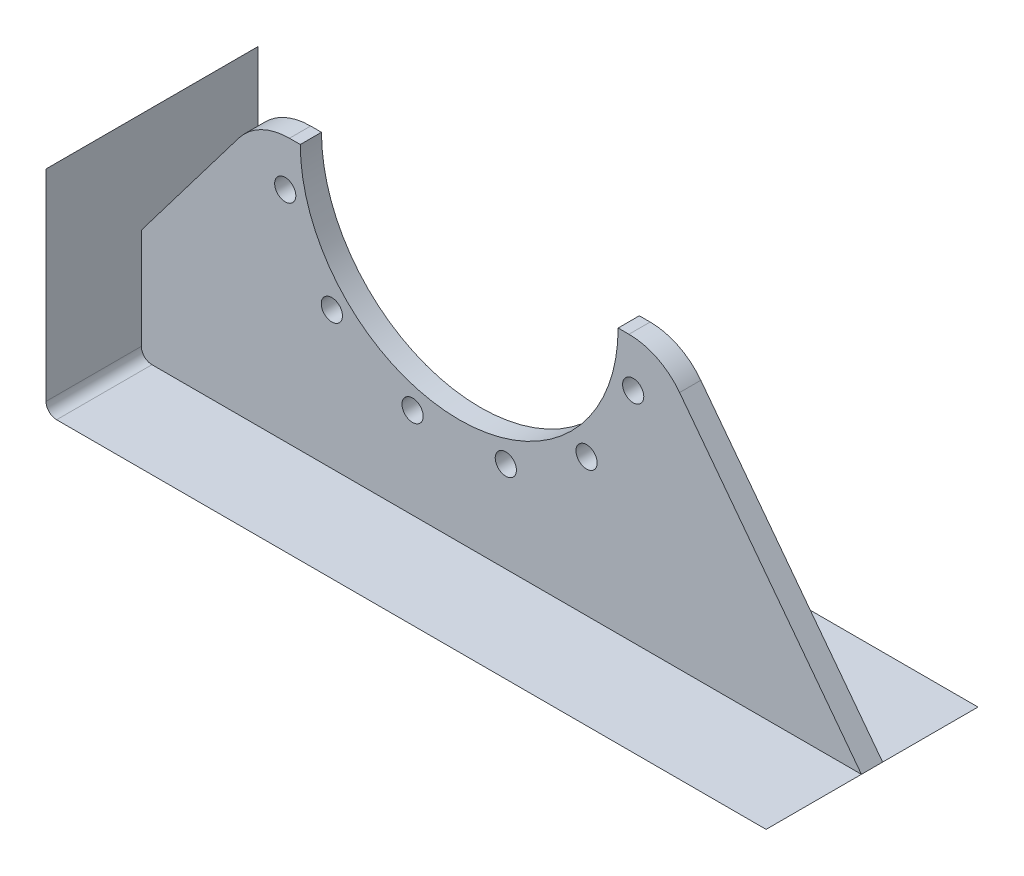
ISO-10303-21;
HEADER;
FILE_DESCRIPTION(('STEP AP214'),'2;1');
FILE_NAME('part.step','',(''),(''),'','','');
FILE_SCHEMA(('AUTOMOTIVE_DESIGN { 1 0 10303 214 1 1 1 1 }'));
ENDSEC;
DATA;
#1=APPLICATION_CONTEXT('core data for automotive mechanical design processes');
#2=APPLICATION_PROTOCOL_DEFINITION('international standard','automotive_design',2000,#1);
#3=PRODUCT_CONTEXT('',#1,'mechanical');
#4=PRODUCT('Part','Part','',(#3));
#5=PRODUCT_RELATED_PRODUCT_CATEGORY('part','',(#4));
#6=PRODUCT_DEFINITION_FORMATION('','',#4);
#7=PRODUCT_DEFINITION_CONTEXT('part definition',#1,'design');
#8=PRODUCT_DEFINITION('design','',#6,#7);
#9=PRODUCT_DEFINITION_SHAPE('','',#8);
#10=(LENGTH_UNIT() NAMED_UNIT(*) SI_UNIT(.MILLI.,.METRE.));
#11=(NAMED_UNIT(*) PLANE_ANGLE_UNIT() SI_UNIT($,.RADIAN.));
#12=(NAMED_UNIT(*) SI_UNIT($,.STERADIAN.) SOLID_ANGLE_UNIT());
#13=UNCERTAINTY_MEASURE_WITH_UNIT(LENGTH_MEASURE(1.E-05),#10,'distance_accuracy_value','');
#14=(GEOMETRIC_REPRESENTATION_CONTEXT(3) GLOBAL_UNCERTAINTY_ASSIGNED_CONTEXT((#13)) GLOBAL_UNIT_ASSIGNED_CONTEXT((#10,
#11,#12)) REPRESENTATION_CONTEXT('',''));
#15=CARTESIAN_POINT('',(0.,0.,0.));
#16=DIRECTION('',(0.,0.,1.));
#17=DIRECTION('',(1.,0.,0.));
#18=AXIS2_PLACEMENT_3D('',#15,#16,#17);
#19=CARTESIAN_POINT('',(0.,0.,0.));
#20=DIRECTION('',(0.,0.,1.));
#21=DIRECTION('',(1.,0.,0.));
#22=AXIS2_PLACEMENT_3D('',#19,#20,#21);
#23=PLANE('',#22);
#24=CARTESIAN_POINT('',(208.54338589581,-55.8790318376344,0.));
#25=DIRECTION('',(0.,0.,1.));
#26=DIRECTION('',(1.,0.,0.));
#27=AXIS2_PLACEMENT_3D('',#24,#25,#26);
#28=CIRCLE('',#27,12.7);
#29=CARTESIAN_POINT('',(221.24338589581,-55.8790318376344,0.));
#30=VERTEX_POINT('',#29);
#31=EDGE_CURVE('E181',#30,#30,#28,.T.);
#32=ORIENTED_EDGE('',*,*,#31,.F.);
#33=EDGE_LOOP('',(#32));
#34=FACE_BOUND('',#33,.T.);
#35=CARTESIAN_POINT('',(152.664354058176,-152.664354058176,0.));
#36=DIRECTION('',(0.,0.,1.));
#37=DIRECTION('',(1.,0.,0.));
#38=AXIS2_PLACEMENT_3D('',#35,#36,#37);
#39=CIRCLE('',#38,12.7);
#40=CARTESIAN_POINT('',(165.364354058176,-152.664354058176,0.));
#41=VERTEX_POINT('',#40);
#42=EDGE_CURVE('E177',#41,#41,#39,.T.);
#43=ORIENTED_EDGE('',*,*,#42,.F.);
#44=EDGE_LOOP('',(#43));
#45=FACE_BOUND('',#44,.T.);
#46=CARTESIAN_POINT('',(55.8790318376341,-208.54338589581,0.));
#47=DIRECTION('',(0.,0.,1.));
#48=DIRECTION('',(1.,0.,0.));
#49=AXIS2_PLACEMENT_3D('',#46,#47,#48);
#50=CIRCLE('',#49,12.7);
#51=CARTESIAN_POINT('',(68.5790318376341,-208.54338589581,0.));
#52=VERTEX_POINT('',#51);
#53=EDGE_CURVE('E173',#52,#52,#50,.T.);
#54=ORIENTED_EDGE('',*,*,#53,.F.);
#55=EDGE_LOOP('',(#54));
#56=FACE_BOUND('',#55,.T.);
#57=CARTESIAN_POINT('',(-55.8790318376344,-208.54338589581,0.));
#58=DIRECTION('',(0.,0.,1.));
#59=DIRECTION('',(1.,0.,0.));
#60=AXIS2_PLACEMENT_3D('',#57,#58,#59);
#61=CIRCLE('',#60,12.7);
#62=CARTESIAN_POINT('',(-43.1790318376343,-208.54338589581,0.));
#63=VERTEX_POINT('',#62);
#64=EDGE_CURVE('E169',#63,#63,#61,.T.);
#65=ORIENTED_EDGE('',*,*,#64,.F.);
#66=EDGE_LOOP('',(#65));
#67=FACE_BOUND('',#66,.T.);
#68=CARTESIAN_POINT('',(-152.664354058176,-152.664354058176,0.));
#69=DIRECTION('',(0.,0.,1.));
#70=DIRECTION('',(1.,0.,0.));
#71=AXIS2_PLACEMENT_3D('',#68,#69,#70);
#72=CIRCLE('',#71,12.7);
#73=CARTESIAN_POINT('',(-139.964354058176,-152.664354058176,0.));
#74=VERTEX_POINT('',#73);
#75=EDGE_CURVE('E165',#74,#74,#72,.T.);
#76=ORIENTED_EDGE('',*,*,#75,.F.);
#77=EDGE_LOOP('',(#76));
#78=FACE_BOUND('',#77,.T.);
#79=CARTESIAN_POINT('',(-208.54338589581,-55.8790318376342,0.));
#80=DIRECTION('',(0.,0.,1.));
#81=DIRECTION('',(1.,0.,0.));
#82=AXIS2_PLACEMENT_3D('',#79,#80,#81);
#83=CIRCLE('',#82,12.7);
#84=CARTESIAN_POINT('',(-195.84338589581,-55.8790318376342,0.));
#85=VERTEX_POINT('',#84);
#86=EDGE_CURVE('E103',#85,#85,#83,.T.);
#87=ORIENTED_EDGE('',*,*,#86,.F.);
#88=EDGE_LOOP('',(#87));
#89=FACE_BOUND('',#88,.T.);
#90=CARTESIAN_POINT('',(0.,0.,0.));
#91=DIRECTION('',(0.,0.,-1.));
#92=DIRECTION('',(1.,0.,0.));
#93=AXIS2_PLACEMENT_3D('',#90,#91,#92);
#94=CIRCLE('',#93,190.5);
#95=CARTESIAN_POINT('',(190.5,0.,0.));
#96=VERTEX_POINT('',#95);
#97=CARTESIAN_POINT('',(-190.5,0.,0.));
#98=VERTEX_POINT('',#97);
#99=EDGE_CURVE('E71',#96,#98,#94,.T.);
#100=ORIENTED_EDGE('',*,*,#99,.T.);
#101=DIRECTION('',(-1.,0.,0.));
#102=VECTOR('',#101,1.);
#103=CARTESIAN_POINT('',(-190.5,0.,0.));
#104=LINE('',#103,#102);
#105=CARTESIAN_POINT('',(-203.461314902901,0.,0.));
#106=VERTEX_POINT('',#105);
#107=EDGE_CURVE('E100',#98,#106,#104,.T.);
#108=ORIENTED_EDGE('',*,*,#107,.T.);
#109=CARTESIAN_POINT('',(-203.461314902901,-76.2000000000001,0.));
#110=DIRECTION('',(0.,0.,1.));
#111=DIRECTION('',(1.,0.,0.));
#112=AXIS2_PLACEMENT_3D('',#109,#110,#111);
#113=CIRCLE('',#112,76.2);
#114=CARTESIAN_POINT('',(-264.169189745663,-30.1457501192836,0.));
#115=VERTEX_POINT('',#114);
#116=EDGE_CURVE('E106',#106,#115,#113,.T.);
#117=ORIENTED_EDGE('',*,*,#116,.T.);
#118=DIRECTION('',(-0.604386481374232,-0.796691270902397,0.));
#119=VECTOR('',#118,1.);
#120=CARTESIAN_POINT('',(-264.169189745663,-30.1457501192836,0.));
#121=LINE('',#120,#119);
#122=CARTESIAN_POINT('',(-381.,-184.15,0.));
#123=VERTEX_POINT('',#122);
#124=EDGE_CURVE('E111',#115,#123,#121,.T.);
#125=ORIENTED_EDGE('',*,*,#124,.T.);
#126=DIRECTION('',(0.,-1.,0.));
#127=VECTOR('',#126,1.);
#128=CARTESIAN_POINT('',(-381.,-184.15,0.));
#129=LINE('',#128,#127);
#130=CARTESIAN_POINT('',(-381.,-304.8,0.));
#131=VERTEX_POINT('',#130);
#132=EDGE_CURVE('E117',#123,#131,#129,.T.);
#133=ORIENTED_EDGE('',*,*,#132,.T.);
#134=CARTESIAN_POINT('',(-368.3,-304.8,0.));
#135=DIRECTION('',(0.,0.,1.));
#136=DIRECTION('',(1.,0.,0.));
#137=AXIS2_PLACEMENT_3D('',#134,#135,#136);
#138=CIRCLE('',#137,12.7);
#139=CARTESIAN_POINT('',(-368.3,-317.5,0.));
#140=VERTEX_POINT('',#139);
#141=EDGE_CURVE('E120',#131,#140,#138,.T.);
#142=ORIENTED_EDGE('',*,*,#141,.T.);
#143=DIRECTION('',(1.,0.,0.));
#144=VECTOR('',#143,1.);
#145=CARTESIAN_POINT('',(-368.3,-317.5,0.));
#146=LINE('',#145,#144);
#147=CARTESIAN_POINT('',(482.162068965513,-317.5,0.));
#148=VERTEX_POINT('',#147);
#149=EDGE_CURVE('E128',#140,#148,#146,.T.);
#150=ORIENTED_EDGE('',*,*,#149,.T.);
#151=DIRECTION('',(-0.604386481374226,0.796691270902401,0.));
#152=VECTOR('',#151,1.);
#153=CARTESIAN_POINT('',(482.162068965513,-317.5,0.));
#154=LINE('',#153,#152);
#155=CARTESIAN_POINT('',(264.169189745663,-30.145750119284,0.));
#156=VERTEX_POINT('',#155);
#157=EDGE_CURVE('E132',#148,#156,#154,.T.);
#158=ORIENTED_EDGE('',*,*,#157,.T.);
#159=CARTESIAN_POINT('',(203.4613149029,-76.2,0.));
#160=DIRECTION('',(0.,0.,1.));
#161=DIRECTION('',(1.,0.,0.));
#162=AXIS2_PLACEMENT_3D('',#159,#160,#161);
#163=CIRCLE('',#162,76.2);
#164=CARTESIAN_POINT('',(203.4613149029,0.,0.));
#165=VERTEX_POINT('',#164);
#166=EDGE_CURVE('E67',#156,#165,#163,.T.);
#167=ORIENTED_EDGE('',*,*,#166,.T.);
#168=DIRECTION('',(-1.,0.,0.));
#169=VECTOR('',#168,1.);
#170=CARTESIAN_POINT('',(203.4613149029,0.,0.));
#171=LINE('',#170,#169);
#172=EDGE_CURVE('E13',#165,#96,#171,.T.);
#173=ORIENTED_EDGE('',*,*,#172,.T.);
#174=EDGE_LOOP('',(#100,#108,#117,#125,#133,#142,#150,#158,#167,#173));
#175=FACE_BOUND('',#174,.T.);
#176=ADVANCED_FACE('F62',(#34,#45,#56,#67,#78,#89,#175),#23,.T.);
#177=OPEN_SHELL('',(#176));
#178=SHELL_BASED_SURFACE_MODEL('B2',(#177));
#179=CARTESIAN_POINT('',(-381.,-63.5,0.));
#180=DIRECTION('',(-1.,0.,0.));
#181=DIRECTION('',(0.,-1.,0.));
#182=AXIS2_PLACEMENT_3D('',#179,#180,#181);
#183=PLANE('',#182);
#184=DIRECTION('',(0.,-1.,0.));
#185=VECTOR('',#184,1.);
#186=CARTESIAN_POINT('',(-381.,-63.5,127.));
#187=LINE('',#186,#185);
#188=CARTESIAN_POINT('',(-381.,-63.5,127.));
#189=VERTEX_POINT('',#188);
#190=CARTESIAN_POINT('',(-381.,-304.8,127.));
#191=VERTEX_POINT('',#190);
#192=EDGE_CURVE('E250',#189,#191,#187,.T.);
#193=ORIENTED_EDGE('',*,*,#192,.F.);
#194=DIRECTION('',(0.,0.,1.));
#195=VECTOR('',#194,1.);
#196=CARTESIAN_POINT('',(-381.,-63.5,0.));
#197=LINE('',#196,#195);
#198=CARTESIAN_POINT('',(-381.,-63.5,-127.));
#199=VERTEX_POINT('',#198);
#200=EDGE_CURVE('E60',#199,#189,#197,.T.);
#201=ORIENTED_EDGE('',*,*,#200,.F.);
#202=DIRECTION('',(0.,-1.,0.));
#203=VECTOR('',#202,1.);
#204=CARTESIAN_POINT('',(-381.,-63.5,-127.));
#205=LINE('',#204,#203);
#206=CARTESIAN_POINT('',(-381.,-304.8,-127.));
#207=VERTEX_POINT('',#206);
#208=EDGE_CURVE('E283',#199,#207,#205,.T.);
#209=ORIENTED_EDGE('',*,*,#208,.T.);
#210=DIRECTION('',(0.,0.,1.));
#211=VECTOR('',#210,1.);
#212=CARTESIAN_POINT('',(-381.,-304.8,0.));
#213=LINE('',#212,#211);
#214=EDGE_CURVE('E302',#207,#191,#213,.T.);
#215=ORIENTED_EDGE('',*,*,#214,.T.);
#216=EDGE_LOOP('',(#193,#201,#209,#215));
#217=FACE_BOUND('',#216,.T.);
#218=ADVANCED_FACE('F244',(#217),#183,.T.);
#219=CARTESIAN_POINT('',(-368.3,-304.8,0.));
#220=DIRECTION('',(0.,0.,1.));
#221=DIRECTION('',(1.,0.,0.));
#222=AXIS2_PLACEMENT_3D('',#219,#220,#221);
#223=CYLINDRICAL_SURFACE('',#222,12.7);
#224=CARTESIAN_POINT('',(-368.3,-304.8,127.));
#225=DIRECTION('',(0.,0.,1.));
#226=DIRECTION('',(1.,0.,0.));
#227=AXIS2_PLACEMENT_3D('',#224,#225,#226);
#228=CIRCLE('',#227,12.7);
#229=CARTESIAN_POINT('',(-368.3,-317.5,127.));
#230=VERTEX_POINT('',#229);
#231=EDGE_CURVE('E303',#191,#230,#228,.T.);
#232=ORIENTED_EDGE('',*,*,#231,.F.);
#233=ORIENTED_EDGE('',*,*,#214,.F.);
#234=CARTESIAN_POINT('',(-368.3,-304.8,-127.));
#235=DIRECTION('',(0.,0.,1.));
#236=DIRECTION('',(1.,0.,0.));
#237=AXIS2_PLACEMENT_3D('',#234,#235,#236);
#238=CIRCLE('',#237,12.7);
#239=CARTESIAN_POINT('',(-368.3,-317.5,-127.));
#240=VERTEX_POINT('',#239);
#241=EDGE_CURVE('E287',#207,#240,#238,.T.);
#242=ORIENTED_EDGE('',*,*,#241,.T.);
#243=DIRECTION('',(0.,0.,1.));
#244=VECTOR('',#243,1.);
#245=CARTESIAN_POINT('',(-368.3,-317.5,0.));
#246=LINE('',#245,#244);
#247=EDGE_CURVE('E293',#240,#230,#246,.T.);
#248=ORIENTED_EDGE('',*,*,#247,.T.);
#249=EDGE_LOOP('',(#232,#233,#242,#248));
#250=FACE_BOUND('',#249,.T.);
#251=ADVANCED_FACE('F310',(#250),#223,.T.);
#252=CARTESIAN_POINT('',(-368.3,-317.5,0.));
#253=DIRECTION('',(0.,-1.,0.));
#254=DIRECTION('',(0.,0.,-1.));
#255=AXIS2_PLACEMENT_3D('',#252,#253,#254);
#256=PLANE('',#255);
#257=DIRECTION('',(1.,0.,0.));
#258=VECTOR('',#257,1.);
#259=CARTESIAN_POINT('',(-368.3,-317.5,127.));
#260=LINE('',#259,#258);
#261=CARTESIAN_POINT('',(482.162068965513,-317.5,127.));
#262=VERTEX_POINT('',#261);
#263=EDGE_CURVE('E261',#230,#262,#260,.T.);
#264=ORIENTED_EDGE('',*,*,#263,.F.);
#265=ORIENTED_EDGE('',*,*,#247,.F.);
#266=DIRECTION('',(1.,0.,0.));
#267=VECTOR('',#266,1.);
#268=CARTESIAN_POINT('',(-368.3,-317.5,-127.));
#269=LINE('',#268,#267);
#270=CARTESIAN_POINT('',(482.162068965513,-317.5,-127.));
#271=VERTEX_POINT('',#270);
#272=EDGE_CURVE('E295',#240,#271,#269,.T.);
#273=ORIENTED_EDGE('',*,*,#272,.T.);
#274=DIRECTION('',(0.,0.,1.));
#275=VECTOR('',#274,1.);
#276=CARTESIAN_POINT('',(482.162068965513,-317.5,0.));
#277=LINE('',#276,#275);
#278=EDGE_CURVE('E257',#271,#262,#277,.T.);
#279=ORIENTED_EDGE('',*,*,#278,.T.);
#280=EDGE_LOOP('',(#264,#265,#273,#279));
#281=FACE_BOUND('',#280,.T.);
#282=ADVANCED_FACE('F312',(#281),#256,.T.);
#283=OPEN_SHELL('',(#218,#251,#282));
#284=SHELL_BASED_SURFACE_MODEL('B7',(#283));
#285=CARTESIAN_POINT('',(-368.3,-304.8,-12.7));
#286=DIRECTION('',(0.,0.,1.));
#287=DIRECTION('',(1.,0.,0.));
#288=AXIS2_PLACEMENT_3D('',#285,#286,#287);
#289=CYLINDRICAL_SURFACE('',#288,12.7);
#290=DIRECTION('',(0.,0.,1.));
#291=VECTOR('',#290,1.);
#292=CARTESIAN_POINT('',(-368.3,-317.5,-12.7));
#293=LINE('',#292,#291);
#294=CARTESIAN_POINT('',(-368.3,-317.5,-12.7));
#295=VERTEX_POINT('',#294);
#296=CARTESIAN_POINT('',(-368.3,-317.5,12.7));
#297=VERTEX_POINT('',#296);
#298=EDGE_CURVE('E431',#295,#297,#293,.T.);
#299=ORIENTED_EDGE('',*,*,#298,.T.);
#300=CARTESIAN_POINT('',(-368.3,-304.8,12.7));
#301=DIRECTION('',(0.,0.,1.));
#302=DIRECTION('',(1.,0.,0.));
#303=AXIS2_PLACEMENT_3D('',#300,#301,#302);
#304=CIRCLE('',#303,12.7);
#305=CARTESIAN_POINT('',(-381.,-304.8,12.7));
#306=VERTEX_POINT('',#305);
#307=EDGE_CURVE('E435',#297,#306,#304,.F.);
#308=ORIENTED_EDGE('',*,*,#307,.T.);
#309=DIRECTION('',(0.,0.,1.));
#310=VECTOR('',#309,1.);
#311=CARTESIAN_POINT('',(-381.,-304.8,-12.7));
#312=LINE('',#311,#310);
#313=CARTESIAN_POINT('',(-381.,-304.8,-12.7));
#314=VERTEX_POINT('',#313);
#315=EDGE_CURVE('E523',#314,#306,#312,.T.);
#316=ORIENTED_EDGE('',*,*,#315,.F.);
#317=CARTESIAN_POINT('',(-368.3,-304.8,-12.7));
#318=DIRECTION('',(0.,0.,1.));
#319=DIRECTION('',(1.,0.,0.));
#320=AXIS2_PLACEMENT_3D('',#317,#318,#319);
#321=CIRCLE('',#320,12.7);
#322=EDGE_CURVE('E438',#295,#314,#321,.F.);
#323=ORIENTED_EDGE('',*,*,#322,.F.);
#324=EDGE_LOOP('',(#299,#308,#316,#323));
#325=FACE_BOUND('',#324,.T.);
#326=ADVANCED_FACE('F354',(#325),#289,.T.);
#327=CARTESIAN_POINT('',(-381.,0.,-12.7));
#328=DIRECTION('',(1.,0.,0.));
#329=DIRECTION('',(0.,1.,0.));
#330=AXIS2_PLACEMENT_3D('',#327,#328,#329);
#331=PLANE('',#330);
#332=ORIENTED_EDGE('',*,*,#315,.T.);
#333=DIRECTION('',(0.,1.,0.));
#334=VECTOR('',#333,1.);
#335=CARTESIAN_POINT('',(-381.,0.,12.7));
#336=LINE('',#335,#334);
#337=CARTESIAN_POINT('',(-381.,-184.15,12.7));
#338=VERTEX_POINT('',#337);
#339=EDGE_CURVE('E458',#306,#338,#336,.T.);
#340=ORIENTED_EDGE('',*,*,#339,.T.);
#341=DIRECTION('',(0.,0.,1.));
#342=VECTOR('',#341,1.);
#343=CARTESIAN_POINT('',(-381.,-184.15,-12.7));
#344=LINE('',#343,#342);
#345=CARTESIAN_POINT('',(-381.,-184.15,-12.7));
#346=VERTEX_POINT('',#345);
#347=EDGE_CURVE('E526',#346,#338,#344,.T.);
#348=ORIENTED_EDGE('',*,*,#347,.F.);
#349=DIRECTION('',(0.,1.,0.));
#350=VECTOR('',#349,1.);
#351=CARTESIAN_POINT('',(-381.,0.,-12.7));
#352=LINE('',#351,#350);
#353=EDGE_CURVE('E503',#314,#346,#352,.T.);
#354=ORIENTED_EDGE('',*,*,#353,.F.);
#355=EDGE_LOOP('',(#332,#340,#348,#354));
#356=FACE_BOUND('',#355,.T.);
#357=ADVANCED_FACE('F561',(#356),#331,.F.);
#358=CARTESIAN_POINT('',(-153.15720754717,116.188226415094,-12.7));
#359=DIRECTION('',(-0.796691270902396,0.604386481374231,0.));
#360=DIRECTION('',(-0.604386481374232,-0.796691270902397,0.));
#361=AXIS2_PLACEMENT_3D('',#358,#359,#360);
#362=PLANE('',#361);
#363=DIRECTION('',(-0.604386481374231,-0.796691270902396,0.));
#364=VECTOR('',#363,1.);
#365=CARTESIAN_POINT('',(-153.15720754717,116.188226415094,12.7));
#366=LINE('',#365,#364);
#367=CARTESIAN_POINT('',(-264.169189745663,-30.1457501192836,12.7));
#368=VERTEX_POINT('',#367);
#369=EDGE_CURVE('E469',#368,#338,#366,.T.);
#370=ORIENTED_EDGE('',*,*,#369,.F.);
#371=DIRECTION('',(0.,0.,1.));
#372=VECTOR('',#371,1.);
#373=CARTESIAN_POINT('',(-264.169189745663,-30.1457501192836,-12.7));
#374=LINE('',#373,#372);
#375=CARTESIAN_POINT('',(-264.169189745663,-30.1457501192836,-12.7));
#376=VERTEX_POINT('',#375);
#377=EDGE_CURVE('E541',#368,#376,#374,.F.);
#378=ORIENTED_EDGE('',*,*,#377,.T.);
#379=DIRECTION('',(-0.604386481374231,-0.796691270902396,0.));
#380=VECTOR('',#379,1.);
#381=CARTESIAN_POINT('',(-153.15720754717,116.188226415094,-12.7));
#382=LINE('',#381,#380);
#383=EDGE_CURVE('E501',#376,#346,#382,.T.);
#384=ORIENTED_EDGE('',*,*,#383,.T.);
#385=ORIENTED_EDGE('',*,*,#347,.T.);
#386=EDGE_LOOP('',(#370,#378,#384,#385));
#387=FACE_BOUND('',#386,.T.);
#388=ADVANCED_FACE('F566',(#387),#362,.T.);
#389=CARTESIAN_POINT('',(0.,0.,-12.7));
#390=DIRECTION('',(0.,-1.,0.));
#391=DIRECTION('',(1.,0.,0.));
#392=AXIS2_PLACEMENT_3D('',#389,#390,#391);
#393=PLANE('',#392);
#394=DIRECTION('',(1.,0.,0.));
#395=VECTOR('',#394,1.);
#396=CARTESIAN_POINT('',(0.,0.,-12.7));
#397=LINE('',#396,#395);
#398=CARTESIAN_POINT('',(-203.461314902901,0.,-12.7));
#399=VERTEX_POINT('',#398);
#400=CARTESIAN_POINT('',(-190.5,0.,-12.7));
#401=VERTEX_POINT('',#400);
#402=EDGE_CURVE('E499',#399,#401,#397,.T.);
#403=ORIENTED_EDGE('',*,*,#402,.F.);
#404=DIRECTION('',(0.,0.,1.));
#405=VECTOR('',#404,1.);
#406=CARTESIAN_POINT('',(-203.461314902901,0.,12.7));
#407=LINE('',#406,#405);
#408=CARTESIAN_POINT('',(-203.461314902901,0.,12.7));
#409=VERTEX_POINT('',#408);
#410=EDGE_CURVE('E525',#399,#409,#407,.T.);
#411=ORIENTED_EDGE('',*,*,#410,.T.);
#412=DIRECTION('',(1.,0.,0.));
#413=VECTOR('',#412,1.);
#414=CARTESIAN_POINT('',(0.,0.,12.7));
#415=LINE('',#414,#413);
#416=CARTESIAN_POINT('',(-190.5,0.,12.7));
#417=VERTEX_POINT('',#416);
#418=EDGE_CURVE('E467',#409,#417,#415,.T.);
#419=ORIENTED_EDGE('',*,*,#418,.T.);
#420=DIRECTION('',(0.,0.,1.));
#421=VECTOR('',#420,1.);
#422=CARTESIAN_POINT('',(-190.5,0.,-12.7));
#423=LINE('',#422,#421);
#424=EDGE_CURVE('E529',#401,#417,#423,.T.);
#425=ORIENTED_EDGE('',*,*,#424,.F.);
#426=EDGE_LOOP('',(#403,#411,#419,#425));
#427=FACE_BOUND('',#426,.T.);
#428=ADVANCED_FACE('F582',(#427),#393,.F.);
#429=CARTESIAN_POINT('',(0.,0.,-12.7));
#430=DIRECTION('',(0.,0.,1.));
#431=DIRECTION('',(1.,0.,0.));
#432=AXIS2_PLACEMENT_3D('',#429,#430,#431);
#433=CYLINDRICAL_SURFACE('',#432,190.5);
#434=ORIENTED_EDGE('',*,*,#424,.T.);
#435=CARTESIAN_POINT('',(0.,0.,12.7));
#436=DIRECTION('',(0.,0.,1.));
#437=DIRECTION('',(1.,0.,0.));
#438=AXIS2_PLACEMENT_3D('',#435,#436,#437);
#439=CIRCLE('',#438,190.5);
#440=CARTESIAN_POINT('',(190.5,0.,12.7));
#441=VERTEX_POINT('',#440);
#442=EDGE_CURVE('E464',#417,#441,#439,.T.);
#443=ORIENTED_EDGE('',*,*,#442,.T.);
#444=DIRECTION('',(0.,0.,1.));
#445=VECTOR('',#444,1.);
#446=CARTESIAN_POINT('',(190.5,0.,-12.7));
#447=LINE('',#446,#445);
#448=CARTESIAN_POINT('',(190.5,0.,-12.7));
#449=VERTEX_POINT('',#448);
#450=EDGE_CURVE('E532',#449,#441,#447,.T.);
#451=ORIENTED_EDGE('',*,*,#450,.F.);
#452=CARTESIAN_POINT('',(0.,0.,-12.7));
#453=DIRECTION('',(0.,0.,1.));
#454=DIRECTION('',(1.,0.,0.));
#455=AXIS2_PLACEMENT_3D('',#452,#453,#454);
#456=CIRCLE('',#455,190.5);
#457=EDGE_CURVE('E497',#401,#449,#456,.T.);
#458=ORIENTED_EDGE('',*,*,#457,.F.);
#459=EDGE_LOOP('',(#434,#443,#451,#458));
#460=FACE_BOUND('',#459,.T.);
#461=ADVANCED_FACE('F579',(#460),#433,.F.);
#462=CARTESIAN_POINT('',(0.,0.,-12.7));
#463=DIRECTION('',(0.,-1.,0.));
#464=DIRECTION('',(0.,0.,-1.));
#465=AXIS2_PLACEMENT_3D('',#462,#463,#464);
#466=PLANE('',#465);
#467=DIRECTION('',(1.,0.,0.));
#468=VECTOR('',#467,1.);
#469=CARTESIAN_POINT('',(0.,0.,12.7));
#470=LINE('',#469,#468);
#471=CARTESIAN_POINT('',(203.4613149029,0.,12.7));
#472=VERTEX_POINT('',#471);
#473=EDGE_CURVE('E462',#441,#472,#470,.T.);
#474=ORIENTED_EDGE('',*,*,#473,.T.);
#475=DIRECTION('',(0.,0.,1.));
#476=VECTOR('',#475,1.);
#477=CARTESIAN_POINT('',(203.4613149029,0.,-12.7));
#478=LINE('',#477,#476);
#479=CARTESIAN_POINT('',(203.4613149029,0.,-12.7));
#480=VERTEX_POINT('',#479);
#481=EDGE_CURVE('E242',#472,#480,#478,.F.);
#482=ORIENTED_EDGE('',*,*,#481,.T.);
#483=DIRECTION('',(1.,0.,0.));
#484=VECTOR('',#483,1.);
#485=CARTESIAN_POINT('',(0.,0.,-12.7));
#486=LINE('',#485,#484);
#487=EDGE_CURVE('E495',#449,#480,#486,.T.);
#488=ORIENTED_EDGE('',*,*,#487,.F.);
#489=ORIENTED_EDGE('',*,*,#450,.T.);
#490=EDGE_LOOP('',(#474,#482,#488,#489));
#491=FACE_BOUND('',#490,.T.);
#492=ADVANCED_FACE('F552',(#491),#466,.F.);
#493=CARTESIAN_POINT('',(153.157207547172,116.188226415094,-12.7));
#494=DIRECTION('',(-0.796691270902401,-0.604386481374226,0.));
#495=DIRECTION('',(0.604386481374226,-0.796691270902401,0.));
#496=AXIS2_PLACEMENT_3D('',#493,#494,#495);
#497=PLANE('',#496);
#498=DIRECTION('',(0.604386481374226,-0.796691270902401,0.));
#499=VECTOR('',#498,1.);
#500=CARTESIAN_POINT('',(153.157207547172,116.188226415094,-12.7));
#501=LINE('',#500,#499);
#502=CARTESIAN_POINT('',(264.169189745663,-30.145750119284,-12.7));
#503=VERTEX_POINT('',#502);
#504=CARTESIAN_POINT('',(482.162068965513,-317.5,-12.7));
#505=VERTEX_POINT('',#504);
#506=EDGE_CURVE('E493',#503,#505,#501,.T.);
#507=ORIENTED_EDGE('',*,*,#506,.F.);
#508=DIRECTION('',(0.,0.,1.));
#509=VECTOR('',#508,1.);
#510=CARTESIAN_POINT('',(264.169189745663,-30.145750119284,-12.7));
#511=LINE('',#510,#509);
#512=CARTESIAN_POINT('',(264.169189745663,-30.145750119284,12.7));
#513=VERTEX_POINT('',#512);
#514=EDGE_CURVE('E362',#503,#513,#511,.T.);
#515=ORIENTED_EDGE('',*,*,#514,.T.);
#516=DIRECTION('',(0.604386481374226,-0.796691270902401,0.));
#517=VECTOR('',#516,1.);
#518=CARTESIAN_POINT('',(153.157207547172,116.188226415094,12.7));
#519=LINE('',#518,#517);
#520=CARTESIAN_POINT('',(482.162068965513,-317.5,12.7));
#521=VERTEX_POINT('',#520);
#522=EDGE_CURVE('E452',#513,#521,#519,.T.);
#523=ORIENTED_EDGE('',*,*,#522,.T.);
#524=DIRECTION('',(0.,0.,1.));
#525=VECTOR('',#524,1.);
#526=CARTESIAN_POINT('',(482.162068965513,-317.5,-12.7));
#527=LINE('',#526,#525);
#528=EDGE_CURVE('E442',#505,#521,#527,.T.);
#529=ORIENTED_EDGE('',*,*,#528,.F.);
#530=EDGE_LOOP('',(#507,#515,#523,#529));
#531=FACE_BOUND('',#530,.T.);
#532=ADVANCED_FACE('F548',(#531),#497,.F.);
#533=CARTESIAN_POINT('',(152.664354058176,-152.664354058176,-12.7));
#534=DIRECTION('',(0.,0.,1.));
#535=DIRECTION('',(1.,0.,0.));
#536=AXIS2_PLACEMENT_3D('',#533,#534,#535);
#537=CYLINDRICAL_SURFACE('',#536,12.7);
#538=CARTESIAN_POINT('',(152.664354058176,-152.664354058176,-12.7));
#539=DIRECTION('',(0.,0.,1.));
#540=DIRECTION('',(1.,0.,0.));
#541=AXIS2_PLACEMENT_3D('',#538,#539,#540);
#542=CIRCLE('',#541,12.7);
#543=CARTESIAN_POINT('',(165.364354058176,-152.664354058176,-12.7));
#544=VERTEX_POINT('',#543);
#545=EDGE_CURVE('E518',#544,#544,#542,.T.);
#546=ORIENTED_EDGE('',*,*,#545,.F.);
#547=EDGE_LOOP('',(#546));
#548=FACE_BOUND('',#547,.T.);
#549=CARTESIAN_POINT('',(152.664354058176,-152.664354058176,12.7));
#550=DIRECTION('',(0.,0.,1.));
#551=DIRECTION('',(1.,0.,0.));
#552=AXIS2_PLACEMENT_3D('',#549,#550,#551);
#553=CIRCLE('',#552,12.7);
#554=CARTESIAN_POINT('',(165.364354058176,-152.664354058176,12.7));
#555=VERTEX_POINT('',#554);
#556=EDGE_CURVE('E484',#555,#555,#553,.T.);
#557=ORIENTED_EDGE('',*,*,#556,.T.);
#558=EDGE_LOOP('',(#557));
#559=FACE_BOUND('',#558,.T.);
#560=ADVANCED_FACE('F576',(#548,#559),#537,.F.);
#561=CARTESIAN_POINT('',(55.8790318376341,-208.54338589581,-12.7));
#562=DIRECTION('',(0.,0.,1.));
#563=DIRECTION('',(1.,0.,0.));
#564=AXIS2_PLACEMENT_3D('',#561,#562,#563);
#565=CYLINDRICAL_SURFACE('',#564,12.7);
#566=CARTESIAN_POINT('',(55.8790318376341,-208.54338589581,-12.7));
#567=DIRECTION('',(0.,0.,1.));
#568=DIRECTION('',(1.,0.,0.));
#569=AXIS2_PLACEMENT_3D('',#566,#567,#568);
#570=CIRCLE('',#569,12.7);
#571=CARTESIAN_POINT('',(68.5790318376341,-208.54338589581,-12.7));
#572=VERTEX_POINT('',#571);
#573=EDGE_CURVE('E515',#572,#572,#570,.T.);
#574=ORIENTED_EDGE('',*,*,#573,.F.);
#575=EDGE_LOOP('',(#574));
#576=FACE_BOUND('',#575,.T.);
#577=CARTESIAN_POINT('',(55.8790318376341,-208.54338589581,12.7));
#578=DIRECTION('',(0.,0.,1.));
#579=DIRECTION('',(1.,0.,0.));
#580=AXIS2_PLACEMENT_3D('',#577,#578,#579);
#581=CIRCLE('',#580,12.7);
#582=CARTESIAN_POINT('',(68.5790318376341,-208.54338589581,12.7));
#583=VERTEX_POINT('',#582);
#584=EDGE_CURVE('E481',#583,#583,#581,.T.);
#585=ORIENTED_EDGE('',*,*,#584,.T.);
#586=EDGE_LOOP('',(#585));
#587=FACE_BOUND('',#586,.T.);
#588=ADVANCED_FACE('F600',(#576,#587),#565,.F.);
#589=CARTESIAN_POINT('',(-55.8790318376344,-208.54338589581,-12.7));
#590=DIRECTION('',(0.,0.,1.));
#591=DIRECTION('',(1.,0.,0.));
#592=AXIS2_PLACEMENT_3D('',#589,#590,#591);
#593=CYLINDRICAL_SURFACE('',#592,12.7);
#594=CARTESIAN_POINT('',(-55.8790318376344,-208.54338589581,-12.7));
#595=DIRECTION('',(0.,0.,1.));
#596=DIRECTION('',(1.,0.,0.));
#597=AXIS2_PLACEMENT_3D('',#594,#595,#596);
#598=CIRCLE('',#597,12.7);
#599=CARTESIAN_POINT('',(-43.1790318376343,-208.54338589581,-12.7));
#600=VERTEX_POINT('',#599);
#601=EDGE_CURVE('E512',#600,#600,#598,.T.);
#602=ORIENTED_EDGE('',*,*,#601,.F.);
#603=EDGE_LOOP('',(#602));
#604=FACE_BOUND('',#603,.T.);
#605=CARTESIAN_POINT('',(-55.8790318376344,-208.54338589581,12.7));
#606=DIRECTION('',(0.,0.,1.));
#607=DIRECTION('',(1.,0.,0.));
#608=AXIS2_PLACEMENT_3D('',#605,#606,#607);
#609=CIRCLE('',#608,12.7);
#610=CARTESIAN_POINT('',(-43.1790318376343,-208.54338589581,12.7));
#611=VERTEX_POINT('',#610);
#612=EDGE_CURVE('E478',#611,#611,#609,.T.);
#613=ORIENTED_EDGE('',*,*,#612,.T.);
#614=EDGE_LOOP('',(#613));
#615=FACE_BOUND('',#614,.T.);
#616=ADVANCED_FACE('F596',(#604,#615),#593,.F.);
#617=CARTESIAN_POINT('',(-152.664354058176,-152.664354058176,-12.7));
#618=DIRECTION('',(0.,0.,1.));
#619=DIRECTION('',(1.,0.,0.));
#620=AXIS2_PLACEMENT_3D('',#617,#618,#619);
#621=CYLINDRICAL_SURFACE('',#620,12.7);
#622=CARTESIAN_POINT('',(-152.664354058176,-152.664354058176,-12.7));
#623=DIRECTION('',(0.,0.,1.));
#624=DIRECTION('',(1.,0.,0.));
#625=AXIS2_PLACEMENT_3D('',#622,#623,#624);
#626=CIRCLE('',#625,12.7);
#627=CARTESIAN_POINT('',(-139.964354058176,-152.664354058176,-12.7));
#628=VERTEX_POINT('',#627);
#629=EDGE_CURVE('E509',#628,#628,#626,.T.);
#630=ORIENTED_EDGE('',*,*,#629,.F.);
#631=EDGE_LOOP('',(#630));
#632=FACE_BOUND('',#631,.T.);
#633=CARTESIAN_POINT('',(-152.664354058176,-152.664354058176,12.7));
#634=DIRECTION('',(0.,0.,1.));
#635=DIRECTION('',(1.,0.,0.));
#636=AXIS2_PLACEMENT_3D('',#633,#634,#635);
#637=CIRCLE('',#636,12.7);
#638=CARTESIAN_POINT('',(-139.964354058176,-152.664354058176,12.7));
#639=VERTEX_POINT('',#638);
#640=EDGE_CURVE('E475',#639,#639,#637,.T.);
#641=ORIENTED_EDGE('',*,*,#640,.T.);
#642=EDGE_LOOP('',(#641));
#643=FACE_BOUND('',#642,.T.);
#644=ADVANCED_FACE('F592',(#632,#643),#621,.F.);
#645=CARTESIAN_POINT('',(-208.54338589581,-55.8790318376342,-12.7));
#646=DIRECTION('',(0.,0.,1.));
#647=DIRECTION('',(1.,0.,0.));
#648=AXIS2_PLACEMENT_3D('',#645,#646,#647);
#649=CYLINDRICAL_SURFACE('',#648,12.7);
#650=CARTESIAN_POINT('',(-208.54338589581,-55.8790318376342,-12.7));
#651=DIRECTION('',(0.,0.,1.));
#652=DIRECTION('',(1.,0.,0.));
#653=AXIS2_PLACEMENT_3D('',#650,#651,#652);
#654=CIRCLE('',#653,12.7);
#655=CARTESIAN_POINT('',(-195.84338589581,-55.8790318376342,-12.7));
#656=VERTEX_POINT('',#655);
#657=EDGE_CURVE('E506',#656,#656,#654,.T.);
#658=ORIENTED_EDGE('',*,*,#657,.F.);
#659=EDGE_LOOP('',(#658));
#660=FACE_BOUND('',#659,.T.);
#661=CARTESIAN_POINT('',(-208.54338589581,-55.8790318376342,12.7));
#662=DIRECTION('',(0.,0.,1.));
#663=DIRECTION('',(1.,0.,0.));
#664=AXIS2_PLACEMENT_3D('',#661,#662,#663);
#665=CIRCLE('',#664,12.7);
#666=CARTESIAN_POINT('',(-195.84338589581,-55.8790318376342,12.7));
#667=VERTEX_POINT('',#666);
#668=EDGE_CURVE('E472',#667,#667,#665,.T.);
#669=ORIENTED_EDGE('',*,*,#668,.T.);
#670=EDGE_LOOP('',(#669));
#671=FACE_BOUND('',#670,.T.);
#672=ADVANCED_FACE('F573',(#660,#671),#649,.F.);
#673=CARTESIAN_POINT('',(0.,-317.5,-12.7));
#674=DIRECTION('',(0.,-1.,0.));
#675=DIRECTION('',(0.,0.,-1.));
#676=AXIS2_PLACEMENT_3D('',#673,#674,#675);
#677=PLANE('',#676);
#678=ORIENTED_EDGE('',*,*,#528,.T.);
#679=DIRECTION('',(1.,0.,0.));
#680=VECTOR('',#679,1.);
#681=CARTESIAN_POINT('',(0.,-317.5,12.7));
#682=LINE('',#681,#680);
#683=EDGE_CURVE('E447',#297,#521,#682,.T.);
#684=ORIENTED_EDGE('',*,*,#683,.F.);
#685=ORIENTED_EDGE('',*,*,#298,.F.);
#686=DIRECTION('',(1.,0.,0.));
#687=VECTOR('',#686,1.);
#688=CARTESIAN_POINT('',(0.,-317.5,-12.7));
#689=LINE('',#688,#687);
#690=EDGE_CURVE('E491',#295,#505,#689,.T.);
#691=ORIENTED_EDGE('',*,*,#690,.T.);
#692=EDGE_LOOP('',(#678,#684,#685,#691));
#693=FACE_BOUND('',#692,.T.);
#694=ADVANCED_FACE('F448',(#693),#677,.T.);
#695=CARTESIAN_POINT('',(208.54338589581,-55.8790318376344,-12.7));
#696=DIRECTION('',(0.,0.,1.));
#697=DIRECTION('',(1.,0.,0.));
#698=AXIS2_PLACEMENT_3D('',#695,#696,#697);
#699=CYLINDRICAL_SURFACE('',#698,12.7);
#700=CARTESIAN_POINT('',(208.54338589581,-55.8790318376344,-12.7));
#701=DIRECTION('',(0.,0.,1.));
#702=DIRECTION('',(1.,0.,0.));
#703=AXIS2_PLACEMENT_3D('',#700,#701,#702);
#704=CIRCLE('',#703,12.7);
#705=CARTESIAN_POINT('',(221.24338589581,-55.8790318376344,-12.7));
#706=VERTEX_POINT('',#705);
#707=EDGE_CURVE('E443',#706,#706,#704,.T.);
#708=ORIENTED_EDGE('',*,*,#707,.F.);
#709=EDGE_LOOP('',(#708));
#710=FACE_BOUND('',#709,.T.);
#711=CARTESIAN_POINT('',(208.54338589581,-55.8790318376344,12.7));
#712=DIRECTION('',(0.,0.,1.));
#713=DIRECTION('',(1.,0.,0.));
#714=AXIS2_PLACEMENT_3D('',#711,#712,#713);
#715=CIRCLE('',#714,12.7);
#716=CARTESIAN_POINT('',(221.24338589581,-55.8790318376344,12.7));
#717=VERTEX_POINT('',#716);
#718=EDGE_CURVE('E487',#717,#717,#715,.T.);
#719=ORIENTED_EDGE('',*,*,#718,.T.);
#720=EDGE_LOOP('',(#719));
#721=FACE_BOUND('',#720,.T.);
#722=ADVANCED_FACE('F572',(#710,#721),#699,.F.);
#723=CARTESIAN_POINT('',(0.,0.,-12.7));
#724=DIRECTION('',(0.,0.,1.));
#725=DIRECTION('',(1.,0.,0.));
#726=AXIS2_PLACEMENT_3D('',#723,#724,#725);
#727=PLANE('',#726);
#728=ORIENTED_EDGE('',*,*,#383,.F.);
#729=CARTESIAN_POINT('',(-203.461314902901,-76.2000000000001,-12.7));
#730=DIRECTION('',(0.,0.,1.));
#731=DIRECTION('',(1.,0.,0.));
#732=AXIS2_PLACEMENT_3D('',#729,#730,#731);
#733=CIRCLE('',#732,76.2);
#734=EDGE_CURVE('E544',#376,#399,#733,.F.);
#735=ORIENTED_EDGE('',*,*,#734,.T.);
#736=ORIENTED_EDGE('',*,*,#402,.T.);
#737=ORIENTED_EDGE('',*,*,#457,.T.);
#738=ORIENTED_EDGE('',*,*,#487,.T.);
#739=CARTESIAN_POINT('',(203.4613149029,-76.2,-12.7));
#740=DIRECTION('',(0.,0.,1.));
#741=DIRECTION('',(1.,0.,0.));
#742=AXIS2_PLACEMENT_3D('',#739,#740,#741);
#743=CIRCLE('',#742,76.2);
#744=EDGE_CURVE('E369',#480,#503,#743,.F.);
#745=ORIENTED_EDGE('',*,*,#744,.T.);
#746=ORIENTED_EDGE('',*,*,#506,.T.);
#747=ORIENTED_EDGE('',*,*,#690,.F.);
#748=ORIENTED_EDGE('',*,*,#322,.T.);
#749=ORIENTED_EDGE('',*,*,#353,.T.);
#750=EDGE_LOOP('',(#728,#735,#736,#737,#738,#745,#746,#747,#748,#749));
#751=FACE_BOUND('',#750,.T.);
#752=ORIENTED_EDGE('',*,*,#657,.T.);
#753=EDGE_LOOP('',(#752));
#754=FACE_BOUND('',#753,.T.);
#755=ORIENTED_EDGE('',*,*,#629,.T.);
#756=EDGE_LOOP('',(#755));
#757=FACE_BOUND('',#756,.T.);
#758=ORIENTED_EDGE('',*,*,#601,.T.);
#759=EDGE_LOOP('',(#758));
#760=FACE_BOUND('',#759,.T.);
#761=ORIENTED_EDGE('',*,*,#573,.T.);
#762=EDGE_LOOP('',(#761));
#763=FACE_BOUND('',#762,.T.);
#764=ORIENTED_EDGE('',*,*,#545,.T.);
#765=EDGE_LOOP('',(#764));
#766=FACE_BOUND('',#765,.T.);
#767=ORIENTED_EDGE('',*,*,#707,.T.);
#768=EDGE_LOOP('',(#767));
#769=FACE_BOUND('',#768,.T.);
#770=ADVANCED_FACE('F610',(#751,#754,#757,#760,#763,#766,#769),#727,.F.);
#771=CARTESIAN_POINT('',(0.,0.,12.7));
#772=DIRECTION('',(0.,0.,1.));
#773=DIRECTION('',(1.,0.,0.));
#774=AXIS2_PLACEMENT_3D('',#771,#772,#773);
#775=PLANE('',#774);
#776=ORIENTED_EDGE('',*,*,#418,.F.);
#777=CARTESIAN_POINT('',(-203.461314902901,-76.2000000000001,12.7));
#778=DIRECTION('',(0.,0.,1.));
#779=DIRECTION('',(1.,0.,0.));
#780=AXIS2_PLACEMENT_3D('',#777,#778,#779);
#781=CIRCLE('',#780,76.2);
#782=EDGE_CURVE('E539',#409,#368,#781,.T.);
#783=ORIENTED_EDGE('',*,*,#782,.T.);
#784=ORIENTED_EDGE('',*,*,#369,.T.);
#785=ORIENTED_EDGE('',*,*,#339,.F.);
#786=ORIENTED_EDGE('',*,*,#307,.F.);
#787=ORIENTED_EDGE('',*,*,#683,.T.);
#788=ORIENTED_EDGE('',*,*,#522,.F.);
#789=CARTESIAN_POINT('',(203.4613149029,-76.2,12.7));
#790=DIRECTION('',(0.,0.,1.));
#791=DIRECTION('',(1.,0.,0.));
#792=AXIS2_PLACEMENT_3D('',#789,#790,#791);
#793=CIRCLE('',#792,76.2);
#794=EDGE_CURVE('E537',#513,#472,#793,.T.);
#795=ORIENTED_EDGE('',*,*,#794,.T.);
#796=ORIENTED_EDGE('',*,*,#473,.F.);
#797=ORIENTED_EDGE('',*,*,#442,.F.);
#798=EDGE_LOOP('',(#776,#783,#784,#785,#786,#787,#788,#795,#796,#797));
#799=FACE_BOUND('',#798,.T.);
#800=ORIENTED_EDGE('',*,*,#668,.F.);
#801=EDGE_LOOP('',(#800));
#802=FACE_BOUND('',#801,.T.);
#803=ORIENTED_EDGE('',*,*,#640,.F.);
#804=EDGE_LOOP('',(#803));
#805=FACE_BOUND('',#804,.T.);
#806=ORIENTED_EDGE('',*,*,#612,.F.);
#807=EDGE_LOOP('',(#806));
#808=FACE_BOUND('',#807,.T.);
#809=ORIENTED_EDGE('',*,*,#584,.F.);
#810=EDGE_LOOP('',(#809));
#811=FACE_BOUND('',#810,.T.);
#812=ORIENTED_EDGE('',*,*,#556,.F.);
#813=EDGE_LOOP('',(#812));
#814=FACE_BOUND('',#813,.T.);
#815=ORIENTED_EDGE('',*,*,#718,.F.);
#816=EDGE_LOOP('',(#815));
#817=FACE_BOUND('',#816,.T.);
#818=ADVANCED_FACE('F455',(#799,#802,#805,#808,#811,#814,#817),#775,.T.);
#819=CARTESIAN_POINT('',(-203.461314902901,-76.2000000000001,-12.7));
#820=DIRECTION('',(0.,0.,-1.));
#821=DIRECTION('',(-1.,0.,0.));
#822=AXIS2_PLACEMENT_3D('',#819,#820,#821);
#823=CYLINDRICAL_SURFACE('',#822,76.2);
#824=ORIENTED_EDGE('',*,*,#734,.F.);
#825=ORIENTED_EDGE('',*,*,#377,.F.);
#826=ORIENTED_EDGE('',*,*,#782,.F.);
#827=ORIENTED_EDGE('',*,*,#410,.F.);
#828=EDGE_LOOP('',(#824,#825,#826,#827));
#829=FACE_BOUND('',#828,.T.);
#830=ADVANCED_FACE('F555',(#829),#823,.T.);
#831=CARTESIAN_POINT('',(203.4613149029,-76.2,-12.7));
#832=DIRECTION('',(0.,0.,1.));
#833=DIRECTION('',(1.,0.,0.));
#834=AXIS2_PLACEMENT_3D('',#831,#832,#833);
#835=CYLINDRICAL_SURFACE('',#834,76.2);
#836=ORIENTED_EDGE('',*,*,#744,.F.);
#837=ORIENTED_EDGE('',*,*,#481,.F.);
#838=ORIENTED_EDGE('',*,*,#794,.F.);
#839=ORIENTED_EDGE('',*,*,#514,.F.);
#840=EDGE_LOOP('',(#836,#837,#838,#839));
#841=FACE_BOUND('',#840,.T.);
#842=ADVANCED_FACE('F356',(#841),#835,.T.);
#843=CLOSED_SHELL('',(#326,#357,#388,#428,#461,#492,#532,#560,#588,#616,#644,#672,#694,#722,
#770,#818,#830,#842));
#844=MANIFOLD_SOLID_BREP('B54',#843);
#845=ADVANCED_BREP_SHAPE_REPRESENTATION('',(#18,#844),#14);
#846=MANIFOLD_SURFACE_SHAPE_REPRESENTATION('',(#18,#178,#284),#14);
#847=SHAPE_REPRESENTATION('',(#18),#14);
#848=SHAPE_DEFINITION_REPRESENTATION(#9,#847);
#849=SHAPE_REPRESENTATION_RELATIONSHIP('','',#847,#845);
#850=SHAPE_REPRESENTATION_RELATIONSHIP('','',#847,#846);
ENDSEC;
END-ISO-10303-21;
